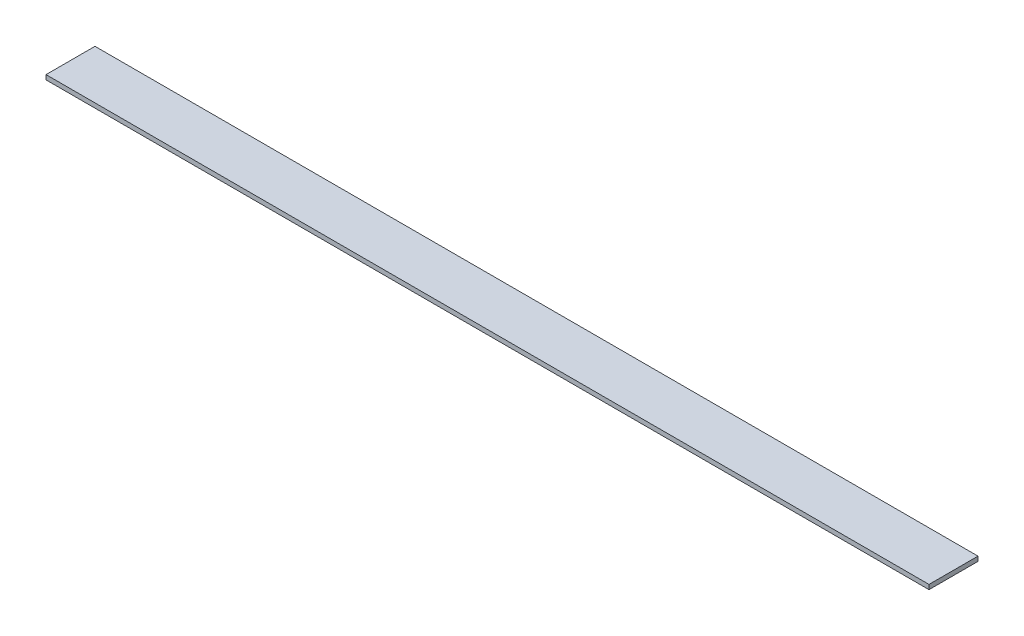
ISO-10303-21;
HEADER;
FILE_DESCRIPTION(('STEP AP214'),'2;1');
FILE_NAME('part.step','',(''),(''),'','','');
FILE_SCHEMA(('AUTOMOTIVE_DESIGN { 1 0 10303 214 1 1 1 1 }'));
ENDSEC;
DATA;
#1=APPLICATION_CONTEXT('core data for automotive mechanical design processes');
#2=APPLICATION_PROTOCOL_DEFINITION('international standard','automotive_design',2000,#1);
#3=PRODUCT_CONTEXT('',#1,'mechanical');
#4=PRODUCT('Part','Part','',(#3));
#5=PRODUCT_RELATED_PRODUCT_CATEGORY('part','',(#4));
#6=PRODUCT_DEFINITION_FORMATION('','',#4);
#7=PRODUCT_DEFINITION_CONTEXT('part definition',#1,'design');
#8=PRODUCT_DEFINITION('design','',#6,#7);
#9=PRODUCT_DEFINITION_SHAPE('','',#8);
#10=(LENGTH_UNIT() NAMED_UNIT(*) SI_UNIT(.MILLI.,.METRE.));
#11=(NAMED_UNIT(*) PLANE_ANGLE_UNIT() SI_UNIT($,.RADIAN.));
#12=(NAMED_UNIT(*) SI_UNIT($,.STERADIAN.) SOLID_ANGLE_UNIT());
#13=UNCERTAINTY_MEASURE_WITH_UNIT(LENGTH_MEASURE(1.E-05),#10,'distance_accuracy_value','');
#14=(GEOMETRIC_REPRESENTATION_CONTEXT(3) GLOBAL_UNCERTAINTY_ASSIGNED_CONTEXT((#13)) GLOBAL_UNIT_ASSIGNED_CONTEXT((#10,
#11,#12)) REPRESENTATION_CONTEXT('',''));
#15=CARTESIAN_POINT('',(0.,0.,0.));
#16=DIRECTION('',(0.,0.,1.));
#17=DIRECTION('',(1.,0.,0.));
#18=AXIS2_PLACEMENT_3D('',#15,#16,#17);
#19=CARTESIAN_POINT('',(0.,3.175,0.));
#20=DIRECTION('',(0.,0.,-1.));
#21=DIRECTION('',(-1.,0.,0.));
#22=AXIS2_PLACEMENT_3D('',#19,#20,#21);
#23=PLANE('',#22);
#24=DIRECTION('',(1.,0.,0.));
#25=VECTOR('',#24,1.);
#26=CARTESIAN_POINT('',(0.,0.,0.));
#27=LINE('',#26,#25);
#28=CARTESIAN_POINT('',(0.,0.,0.));
#29=VERTEX_POINT('',#28);
#30=CARTESIAN_POINT('',(612.775,0.,0.));
#31=VERTEX_POINT('',#30);
#32=EDGE_CURVE('E96',#29,#31,#27,.T.);
#33=ORIENTED_EDGE('',*,*,#32,.T.);
#34=DIRECTION('',(0.,-1.,0.));
#35=VECTOR('',#34,1.);
#36=CARTESIAN_POINT('',(612.775,3.175,0.));
#37=LINE('',#36,#35);
#38=CARTESIAN_POINT('',(612.775,3.175,0.));
#39=VERTEX_POINT('',#38);
#40=EDGE_CURVE('E11',#39,#31,#37,.T.);
#41=ORIENTED_EDGE('',*,*,#40,.F.);
#42=DIRECTION('',(1.,0.,0.));
#43=VECTOR('',#42,1.);
#44=CARTESIAN_POINT('',(0.,3.175,0.));
#45=LINE('',#44,#43);
#46=CARTESIAN_POINT('',(0.,3.175,0.));
#47=VERTEX_POINT('',#46);
#48=EDGE_CURVE('E82',#47,#39,#45,.T.);
#49=ORIENTED_EDGE('',*,*,#48,.F.);
#50=DIRECTION('',(0.,-1.,0.));
#51=VECTOR('',#50,1.);
#52=CARTESIAN_POINT('',(0.,3.175,0.));
#53=LINE('',#52,#51);
#54=EDGE_CURVE('E49',#47,#29,#53,.T.);
#55=ORIENTED_EDGE('',*,*,#54,.T.);
#56=EDGE_LOOP('',(#33,#41,#49,#55));
#57=FACE_BOUND('',#56,.T.);
#58=ADVANCED_FACE('F33',(#57),#23,.F.);
#59=CARTESIAN_POINT('',(612.775,3.175,0.));
#60=DIRECTION('',(-1.,0.,0.));
#61=DIRECTION('',(0.,0.,1.));
#62=AXIS2_PLACEMENT_3D('',#59,#60,#61);
#63=PLANE('',#62);
#64=DIRECTION('',(0.,0.,-1.));
#65=VECTOR('',#64,1.);
#66=CARTESIAN_POINT('',(612.775,0.,0.));
#67=LINE('',#66,#65);
#68=CARTESIAN_POINT('',(612.775,0.,-34.));
#69=VERTEX_POINT('',#68);
#70=EDGE_CURVE('E87',#31,#69,#67,.T.);
#71=ORIENTED_EDGE('',*,*,#70,.T.);
#72=DIRECTION('',(0.,-1.,0.));
#73=VECTOR('',#72,1.);
#74=CARTESIAN_POINT('',(612.775,3.175,-34.));
#75=LINE('',#74,#73);
#76=CARTESIAN_POINT('',(612.775,3.175,-34.));
#77=VERTEX_POINT('',#76);
#78=EDGE_CURVE('E41',#77,#69,#75,.T.);
#79=ORIENTED_EDGE('',*,*,#78,.F.);
#80=DIRECTION('',(0.,0.,-1.));
#81=VECTOR('',#80,1.);
#82=CARTESIAN_POINT('',(612.775,3.175,0.));
#83=LINE('',#82,#81);
#84=EDGE_CURVE('E74',#39,#77,#83,.T.);
#85=ORIENTED_EDGE('',*,*,#84,.F.);
#86=ORIENTED_EDGE('',*,*,#40,.T.);
#87=EDGE_LOOP('',(#71,#79,#85,#86));
#88=FACE_BOUND('',#87,.T.);
#89=ADVANCED_FACE('F86',(#88),#63,.F.);
#90=CARTESIAN_POINT('',(0.,3.175,-34.));
#91=DIRECTION('',(0.,0.,-1.));
#92=DIRECTION('',(-1.,0.,0.));
#93=AXIS2_PLACEMENT_3D('',#90,#91,#92);
#94=PLANE('',#93);
#95=DIRECTION('',(1.,0.,0.));
#96=VECTOR('',#95,1.);
#97=CARTESIAN_POINT('',(0.,0.,-34.));
#98=LINE('',#97,#96);
#99=CARTESIAN_POINT('',(0.,0.,-34.));
#100=VERTEX_POINT('',#99);
#101=EDGE_CURVE('E99',#100,#69,#98,.T.);
#102=ORIENTED_EDGE('',*,*,#101,.F.);
#103=DIRECTION('',(0.,-1.,0.));
#104=VECTOR('',#103,1.);
#105=CARTESIAN_POINT('',(0.,3.175,-34.));
#106=LINE('',#105,#104);
#107=CARTESIAN_POINT('',(0.,3.175,-34.));
#108=VERTEX_POINT('',#107);
#109=EDGE_CURVE('E63',#108,#100,#106,.T.);
#110=ORIENTED_EDGE('',*,*,#109,.F.);
#111=DIRECTION('',(1.,0.,0.));
#112=VECTOR('',#111,1.);
#113=CARTESIAN_POINT('',(0.,3.175,-34.));
#114=LINE('',#113,#112);
#115=EDGE_CURVE('E81',#108,#77,#114,.T.);
#116=ORIENTED_EDGE('',*,*,#115,.T.);
#117=ORIENTED_EDGE('',*,*,#78,.T.);
#118=EDGE_LOOP('',(#102,#110,#116,#117));
#119=FACE_BOUND('',#118,.T.);
#120=ADVANCED_FACE('F90',(#119),#94,.T.);
#121=CARTESIAN_POINT('',(0.,3.175,0.));
#122=DIRECTION('',(-1.,0.,0.));
#123=DIRECTION('',(0.,0.,1.));
#124=AXIS2_PLACEMENT_3D('',#121,#122,#123);
#125=PLANE('',#124);
#126=DIRECTION('',(0.,0.,-1.));
#127=VECTOR('',#126,1.);
#128=CARTESIAN_POINT('',(0.,0.,0.));
#129=LINE('',#128,#127);
#130=EDGE_CURVE('E101',#29,#100,#129,.T.);
#131=ORIENTED_EDGE('',*,*,#130,.F.);
#132=ORIENTED_EDGE('',*,*,#54,.F.);
#133=DIRECTION('',(0.,0.,-1.));
#134=VECTOR('',#133,1.);
#135=CARTESIAN_POINT('',(0.,3.175,0.));
#136=LINE('',#135,#134);
#137=EDGE_CURVE('E91',#47,#108,#136,.T.);
#138=ORIENTED_EDGE('',*,*,#137,.T.);
#139=ORIENTED_EDGE('',*,*,#109,.T.);
#140=EDGE_LOOP('',(#131,#132,#138,#139));
#141=FACE_BOUND('',#140,.T.);
#142=ADVANCED_FACE('F107',(#141),#125,.T.);
#143=CARTESIAN_POINT('',(0.,3.175,0.));
#144=DIRECTION('',(0.,1.,0.));
#145=DIRECTION('',(0.,0.,1.));
#146=AXIS2_PLACEMENT_3D('',#143,#144,#145);
#147=PLANE('',#146);
#148=ORIENTED_EDGE('',*,*,#48,.T.);
#149=ORIENTED_EDGE('',*,*,#84,.T.);
#150=ORIENTED_EDGE('',*,*,#115,.F.);
#151=ORIENTED_EDGE('',*,*,#137,.F.);
#152=EDGE_LOOP('',(#148,#149,#150,#151));
#153=FACE_BOUND('',#152,.T.);
#154=ADVANCED_FACE('F78',(#153),#147,.T.);
#155=CARTESIAN_POINT('',(0.,0.,0.));
#156=DIRECTION('',(0.,1.,0.));
#157=DIRECTION('',(0.,0.,1.));
#158=AXIS2_PLACEMENT_3D('',#155,#156,#157);
#159=PLANE('',#158);
#160=ORIENTED_EDGE('',*,*,#32,.F.);
#161=ORIENTED_EDGE('',*,*,#130,.T.);
#162=ORIENTED_EDGE('',*,*,#101,.T.);
#163=ORIENTED_EDGE('',*,*,#70,.F.);
#164=EDGE_LOOP('',(#160,#161,#162,#163));
#165=FACE_BOUND('',#164,.T.);
#166=ADVANCED_FACE('F106',(#165),#159,.F.);
#167=CLOSED_SHELL('',(#58,#89,#120,#142,#154,#166));
#168=MANIFOLD_SOLID_BREP('B2',#167);
#169=ADVANCED_BREP_SHAPE_REPRESENTATION('',(#18,#168),#14);
#170=SHAPE_DEFINITION_REPRESENTATION(#9,#169);
ENDSEC;
END-ISO-10303-21;
